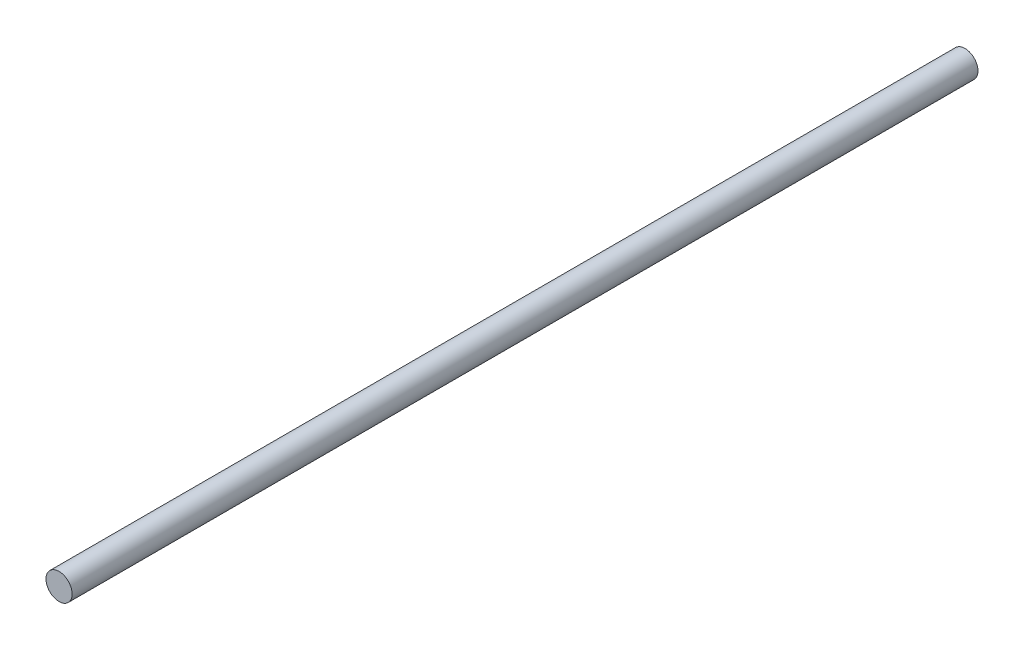
ISO-10303-21;
HEADER;
FILE_DESCRIPTION(('STEP AP214'),'2;1');
FILE_NAME('part.step','',(''),(''),'','','');
FILE_SCHEMA(('AUTOMOTIVE_DESIGN { 1 0 10303 214 1 1 1 1 }'));
ENDSEC;
DATA;
#1=APPLICATION_CONTEXT('core data for automotive mechanical design processes');
#2=APPLICATION_PROTOCOL_DEFINITION('international standard','automotive_design',2000,#1);
#3=PRODUCT_CONTEXT('',#1,'mechanical');
#4=PRODUCT('Part','Part','',(#3));
#5=PRODUCT_RELATED_PRODUCT_CATEGORY('part','',(#4));
#6=PRODUCT_DEFINITION_FORMATION('','',#4);
#7=PRODUCT_DEFINITION_CONTEXT('part definition',#1,'design');
#8=PRODUCT_DEFINITION('design','',#6,#7);
#9=PRODUCT_DEFINITION_SHAPE('','',#8);
#10=(LENGTH_UNIT() NAMED_UNIT(*) SI_UNIT(.MILLI.,.METRE.));
#11=(NAMED_UNIT(*) PLANE_ANGLE_UNIT() SI_UNIT($,.RADIAN.));
#12=(NAMED_UNIT(*) SI_UNIT($,.STERADIAN.) SOLID_ANGLE_UNIT());
#13=UNCERTAINTY_MEASURE_WITH_UNIT(LENGTH_MEASURE(1.E-05),#10,'distance_accuracy_value','');
#14=(GEOMETRIC_REPRESENTATION_CONTEXT(3) GLOBAL_UNCERTAINTY_ASSIGNED_CONTEXT((#13)) GLOBAL_UNIT_ASSIGNED_CONTEXT((#10,
#11,#12)) REPRESENTATION_CONTEXT('',''));
#15=CARTESIAN_POINT('',(0.,0.,0.));
#16=DIRECTION('',(0.,0.,1.));
#17=DIRECTION('',(1.,0.,0.));
#18=AXIS2_PLACEMENT_3D('',#15,#16,#17);
#19=CARTESIAN_POINT('',(0.,0.,104.));
#20=DIRECTION('',(0.,0.,-1.));
#21=DIRECTION('',(-1.,0.,0.));
#22=AXIS2_PLACEMENT_3D('',#19,#20,#21);
#23=CYLINDRICAL_SURFACE('',#22,1.5);
#24=CARTESIAN_POINT('',(0.,0.,104.));
#25=DIRECTION('',(0.,0.,1.));
#26=DIRECTION('',(1.,0.,0.));
#27=AXIS2_PLACEMENT_3D('',#24,#25,#26);
#28=CIRCLE('',#27,1.5);
#29=CARTESIAN_POINT('',(1.5,0.,104.));
#30=VERTEX_POINT('',#29);
#31=EDGE_CURVE('E10',#30,#30,#28,.T.);
#32=ORIENTED_EDGE('',*,*,#31,.F.);
#33=EDGE_LOOP('',(#32));
#34=FACE_BOUND('',#33,.T.);
#35=CARTESIAN_POINT('',(0.,0.,0.));
#36=DIRECTION('',(0.,0.,1.));
#37=DIRECTION('',(1.,0.,0.));
#38=AXIS2_PLACEMENT_3D('',#35,#36,#37);
#39=CIRCLE('',#38,1.5);
#40=CARTESIAN_POINT('',(1.5,0.,0.));
#41=VERTEX_POINT('',#40);
#42=EDGE_CURVE('E36',#41,#41,#39,.T.);
#43=ORIENTED_EDGE('',*,*,#42,.T.);
#44=EDGE_LOOP('',(#43));
#45=FACE_BOUND('',#44,.T.);
#46=ADVANCED_FACE('F33',(#34,#45),#23,.T.);
#47=CARTESIAN_POINT('',(0.,0.,104.));
#48=DIRECTION('',(0.,0.,1.));
#49=DIRECTION('',(1.,0.,0.));
#50=AXIS2_PLACEMENT_3D('',#47,#48,#49);
#51=PLANE('',#50);
#52=ORIENTED_EDGE('',*,*,#31,.T.);
#53=EDGE_LOOP('',(#52));
#54=FACE_BOUND('',#53,.T.);
#55=ADVANCED_FACE('F48',(#54),#51,.T.);
#56=CARTESIAN_POINT('',(0.,0.,0.));
#57=DIRECTION('',(0.,0.,1.));
#58=DIRECTION('',(1.,0.,0.));
#59=AXIS2_PLACEMENT_3D('',#56,#57,#58);
#60=PLANE('',#59);
#61=ORIENTED_EDGE('',*,*,#42,.F.);
#62=EDGE_LOOP('',(#61));
#63=FACE_BOUND('',#62,.T.);
#64=ADVANCED_FACE('F46',(#63),#60,.F.);
#65=CLOSED_SHELL('',(#46,#55,#64));
#66=MANIFOLD_SOLID_BREP('B2',#65);
#67=ADVANCED_BREP_SHAPE_REPRESENTATION('',(#18,#66),#14);
#68=SHAPE_DEFINITION_REPRESENTATION(#9,#67);
ENDSEC;
END-ISO-10303-21;
